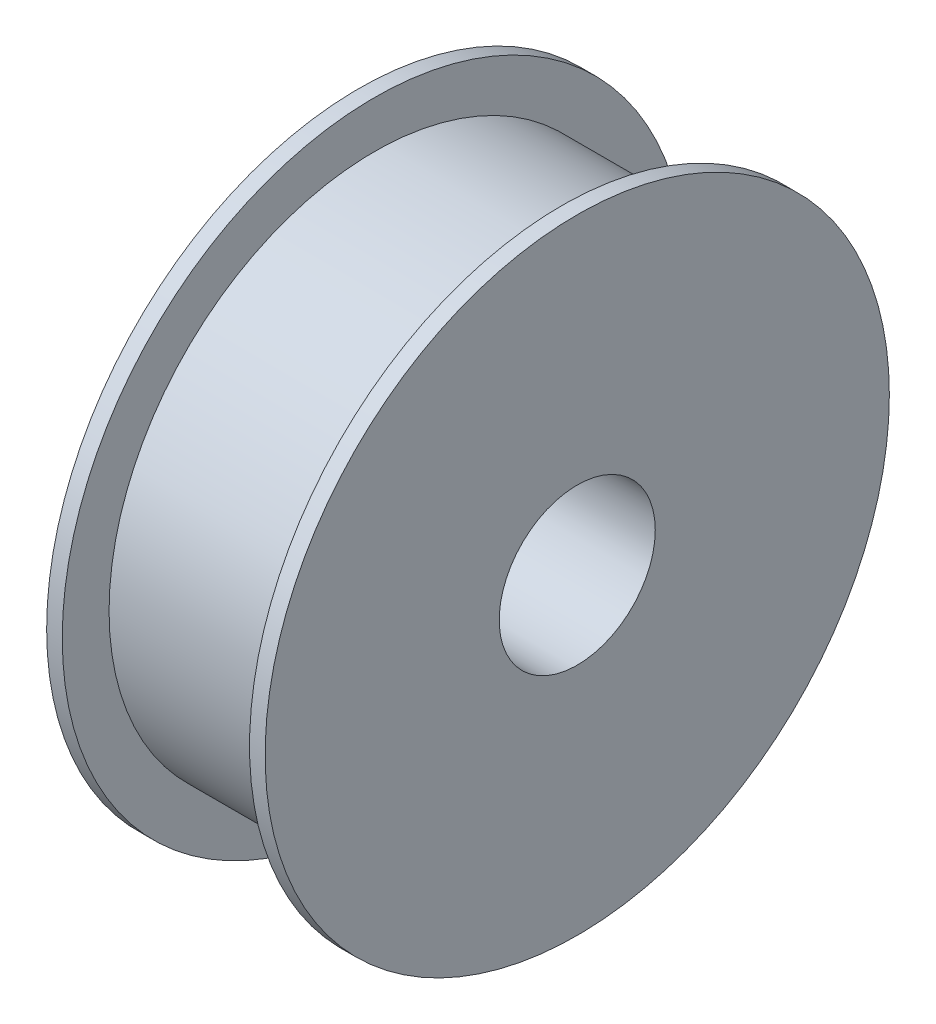
ISO-10303-21;
HEADER;
FILE_DESCRIPTION(('STEP AP214'),'2;1');
FILE_NAME('part.step','',(''),(''),'','','');
FILE_SCHEMA(('AUTOMOTIVE_DESIGN { 1 0 10303 214 1 1 1 1 }'));
ENDSEC;
DATA;
#1=APPLICATION_CONTEXT('core data for automotive mechanical design processes');
#2=APPLICATION_PROTOCOL_DEFINITION('international standard','automotive_design',2000,#1);
#3=PRODUCT_CONTEXT('',#1,'mechanical');
#4=PRODUCT('Part','Part','',(#3));
#5=PRODUCT_RELATED_PRODUCT_CATEGORY('part','',(#4));
#6=PRODUCT_DEFINITION_FORMATION('','',#4);
#7=PRODUCT_DEFINITION_CONTEXT('part definition',#1,'design');
#8=PRODUCT_DEFINITION('design','',#6,#7);
#9=PRODUCT_DEFINITION_SHAPE('','',#8);
#10=(LENGTH_UNIT() NAMED_UNIT(*) SI_UNIT(.MILLI.,.METRE.));
#11=(NAMED_UNIT(*) PLANE_ANGLE_UNIT() SI_UNIT($,.RADIAN.));
#12=(NAMED_UNIT(*) SI_UNIT($,.STERADIAN.) SOLID_ANGLE_UNIT());
#13=UNCERTAINTY_MEASURE_WITH_UNIT(LENGTH_MEASURE(1.E-05),#10,'distance_accuracy_value','');
#14=(GEOMETRIC_REPRESENTATION_CONTEXT(3) GLOBAL_UNCERTAINTY_ASSIGNED_CONTEXT((#13)) GLOBAL_UNIT_ASSIGNED_CONTEXT((#10,
#11,#12)) REPRESENTATION_CONTEXT('',''));
#15=CARTESIAN_POINT('',(0.,0.,0.));
#16=DIRECTION('',(0.,0.,1.));
#17=DIRECTION('',(1.,0.,0.));
#18=AXIS2_PLACEMENT_3D('',#15,#16,#17);
#19=CARTESIAN_POINT('',(5.,0.,0.));
#20=DIRECTION('',(1.,0.,0.));
#21=DIRECTION('',(0.,0.,-1.));
#22=AXIS2_PLACEMENT_3D('',#19,#20,#21);
#23=PLANE('',#22);
#24=CARTESIAN_POINT('',(5.,0.,0.));
#25=DIRECTION('',(1.,0.,0.));
#26=DIRECTION('',(0.,0.,-1.));
#27=AXIS2_PLACEMENT_3D('',#24,#25,#26);
#28=CIRCLE('',#27,100.);
#29=CARTESIAN_POINT('',(5.,0.,-100.));
#30=VERTEX_POINT('',#29);
#31=EDGE_CURVE('E39',#30,#30,#28,.T.);
#32=ORIENTED_EDGE('',*,*,#31,.T.);
#33=EDGE_LOOP('',(#32));
#34=FACE_BOUND('',#33,.T.);
#35=CARTESIAN_POINT('',(5.,0.,0.));
#36=DIRECTION('',(1.,0.,0.));
#37=DIRECTION('',(0.,0.,-1.));
#38=AXIS2_PLACEMENT_3D('',#35,#36,#37);
#39=CIRCLE('',#38,25.);
#40=CARTESIAN_POINT('',(5.,0.,-25.));
#41=VERTEX_POINT('',#40);
#42=EDGE_CURVE('E48',#41,#41,#39,.T.);
#43=ORIENTED_EDGE('',*,*,#42,.F.);
#44=EDGE_LOOP('',(#43));
#45=FACE_BOUND('',#44,.T.);
#46=ADVANCED_FACE('F32',(#34,#45),#23,.T.);
#47=CARTESIAN_POINT('',(0.,0.,0.));
#48=DIRECTION('',(1.,0.,0.));
#49=DIRECTION('',(0.,0.,-1.));
#50=AXIS2_PLACEMENT_3D('',#47,#48,#49);
#51=PLANE('',#50);
#52=CARTESIAN_POINT('',(0.,0.,0.));
#53=DIRECTION('',(1.,0.,0.));
#54=DIRECTION('',(0.,0.,-1.));
#55=AXIS2_PLACEMENT_3D('',#52,#53,#54);
#56=CIRCLE('',#55,85.);
#57=CARTESIAN_POINT('',(0.,0.,-85.));
#58=VERTEX_POINT('',#57);
#59=EDGE_CURVE('E10',#58,#58,#56,.F.);
#60=ORIENTED_EDGE('',*,*,#59,.F.);
#61=EDGE_LOOP('',(#60));
#62=FACE_BOUND('',#61,.T.);
#63=CARTESIAN_POINT('',(0.,0.,0.));
#64=DIRECTION('',(1.,0.,0.));
#65=DIRECTION('',(0.,0.,-1.));
#66=AXIS2_PLACEMENT_3D('',#63,#64,#65);
#67=CIRCLE('',#66,100.);
#68=CARTESIAN_POINT('',(0.,0.,-100.));
#69=VERTEX_POINT('',#68);
#70=EDGE_CURVE('E43',#69,#69,#67,.T.);
#71=ORIENTED_EDGE('',*,*,#70,.F.);
#72=EDGE_LOOP('',(#71));
#73=FACE_BOUND('',#72,.T.);
#74=ADVANCED_FACE('F80',(#62,#73),#51,.F.);
#75=CARTESIAN_POINT('',(5.,0.,0.));
#76=DIRECTION('',(-1.,0.,0.));
#77=DIRECTION('',(0.,0.,1.));
#78=AXIS2_PLACEMENT_3D('',#75,#76,#77);
#79=CYLINDRICAL_SURFACE('',#78,100.);
#80=ORIENTED_EDGE('',*,*,#31,.F.);
#81=EDGE_LOOP('',(#80));
#82=FACE_BOUND('',#81,.T.);
#83=ORIENTED_EDGE('',*,*,#70,.T.);
#84=EDGE_LOOP('',(#83));
#85=FACE_BOUND('',#84,.T.);
#86=ADVANCED_FACE('F34',(#82,#85),#79,.T.);
#87=CARTESIAN_POINT('',(5.,0.,0.));
#88=DIRECTION('',(-1.,0.,0.));
#89=DIRECTION('',(0.,0.,1.));
#90=AXIS2_PLACEMENT_3D('',#87,#88,#89);
#91=CYLINDRICAL_SURFACE('',#90,25.);
#92=ORIENTED_EDGE('',*,*,#42,.T.);
#93=EDGE_LOOP('',(#92));
#94=FACE_BOUND('',#93,.T.);
#95=CARTESIAN_POINT('',(-65.,0.,0.));
#96=DIRECTION('',(1.,0.,0.));
#97=DIRECTION('',(0.,0.,-1.));
#98=AXIS2_PLACEMENT_3D('',#95,#96,#97);
#99=CIRCLE('',#98,25.);
#100=CARTESIAN_POINT('',(-65.,0.,-25.));
#101=VERTEX_POINT('',#100);
#102=EDGE_CURVE('E59',#101,#101,#99,.T.);
#103=ORIENTED_EDGE('',*,*,#102,.F.);
#104=EDGE_LOOP('',(#103));
#105=FACE_BOUND('',#104,.T.);
#106=ADVANCED_FACE('F68',(#94,#105),#91,.F.);
#107=CARTESIAN_POINT('',(-60.,0.,0.));
#108=DIRECTION('',(1.,0.,0.));
#109=DIRECTION('',(0.,0.,-1.));
#110=AXIS2_PLACEMENT_3D('',#107,#108,#109);
#111=CYLINDRICAL_SURFACE('',#110,85.);
#112=CARTESIAN_POINT('',(-60.,0.,0.));
#113=DIRECTION('',(-1.,0.,0.));
#114=DIRECTION('',(0.,0.,1.));
#115=AXIS2_PLACEMENT_3D('',#112,#113,#114);
#116=CIRCLE('',#115,85.);
#117=CARTESIAN_POINT('',(-60.,0.,85.));
#118=VERTEX_POINT('',#117);
#119=EDGE_CURVE('E52',#118,#118,#116,.T.);
#120=ORIENTED_EDGE('',*,*,#119,.F.);
#121=EDGE_LOOP('',(#120));
#122=FACE_BOUND('',#121,.T.);
#123=ORIENTED_EDGE('',*,*,#59,.T.);
#124=EDGE_LOOP('',(#123));
#125=FACE_BOUND('',#124,.T.);
#126=ADVANCED_FACE('F70',(#122,#125),#111,.T.);
#127=CARTESIAN_POINT('',(-65.,0.,0.));
#128=DIRECTION('',(1.,0.,0.));
#129=DIRECTION('',(0.,0.,-1.));
#130=AXIS2_PLACEMENT_3D('',#127,#128,#129);
#131=CYLINDRICAL_SURFACE('',#130,100.);
#132=CARTESIAN_POINT('',(-65.,0.,0.));
#133=DIRECTION('',(-1.,0.,0.));
#134=DIRECTION('',(0.,0.,1.));
#135=AXIS2_PLACEMENT_3D('',#132,#133,#134);
#136=CIRCLE('',#135,100.);
#137=CARTESIAN_POINT('',(-65.,0.,100.));
#138=VERTEX_POINT('',#137);
#139=EDGE_CURVE('E55',#138,#138,#136,.T.);
#140=ORIENTED_EDGE('',*,*,#139,.F.);
#141=EDGE_LOOP('',(#140));
#142=FACE_BOUND('',#141,.T.);
#143=CARTESIAN_POINT('',(-60.,0.,0.));
#144=DIRECTION('',(-1.,0.,0.));
#145=DIRECTION('',(0.,0.,1.));
#146=AXIS2_PLACEMENT_3D('',#143,#144,#145);
#147=CIRCLE('',#146,100.);
#148=CARTESIAN_POINT('',(-60.,0.,100.));
#149=VERTEX_POINT('',#148);
#150=EDGE_CURVE('E56',#149,#149,#147,.T.);
#151=ORIENTED_EDGE('',*,*,#150,.T.);
#152=EDGE_LOOP('',(#151));
#153=FACE_BOUND('',#152,.T.);
#154=ADVANCED_FACE('F77',(#142,#153),#131,.T.);
#155=CARTESIAN_POINT('',(-65.,0.,0.));
#156=DIRECTION('',(-1.,0.,0.));
#157=DIRECTION('',(0.,0.,1.));
#158=AXIS2_PLACEMENT_3D('',#155,#156,#157);
#159=PLANE('',#158);
#160=ORIENTED_EDGE('',*,*,#102,.T.);
#161=EDGE_LOOP('',(#160));
#162=FACE_BOUND('',#161,.T.);
#163=ORIENTED_EDGE('',*,*,#139,.T.);
#164=EDGE_LOOP('',(#163));
#165=FACE_BOUND('',#164,.T.);
#166=ADVANCED_FACE('F65',(#162,#165),#159,.T.);
#167=CARTESIAN_POINT('',(-60.,0.,0.));
#168=DIRECTION('',(-1.,0.,0.));
#169=DIRECTION('',(0.,0.,1.));
#170=AXIS2_PLACEMENT_3D('',#167,#168,#169);
#171=PLANE('',#170);
#172=ORIENTED_EDGE('',*,*,#119,.T.);
#173=EDGE_LOOP('',(#172));
#174=FACE_BOUND('',#173,.T.);
#175=ORIENTED_EDGE('',*,*,#150,.F.);
#176=EDGE_LOOP('',(#175));
#177=FACE_BOUND('',#176,.T.);
#178=ADVANCED_FACE('F121',(#174,#177),#171,.F.);
#179=CLOSED_SHELL('',(#46,#74,#86,#106,#126,#154,#166,#178));
#180=MANIFOLD_SOLID_BREP('B2',#179);
#181=ADVANCED_BREP_SHAPE_REPRESENTATION('',(#18,#180),#14);
#182=SHAPE_DEFINITION_REPRESENTATION(#9,#181);
ENDSEC;
END-ISO-10303-21;
